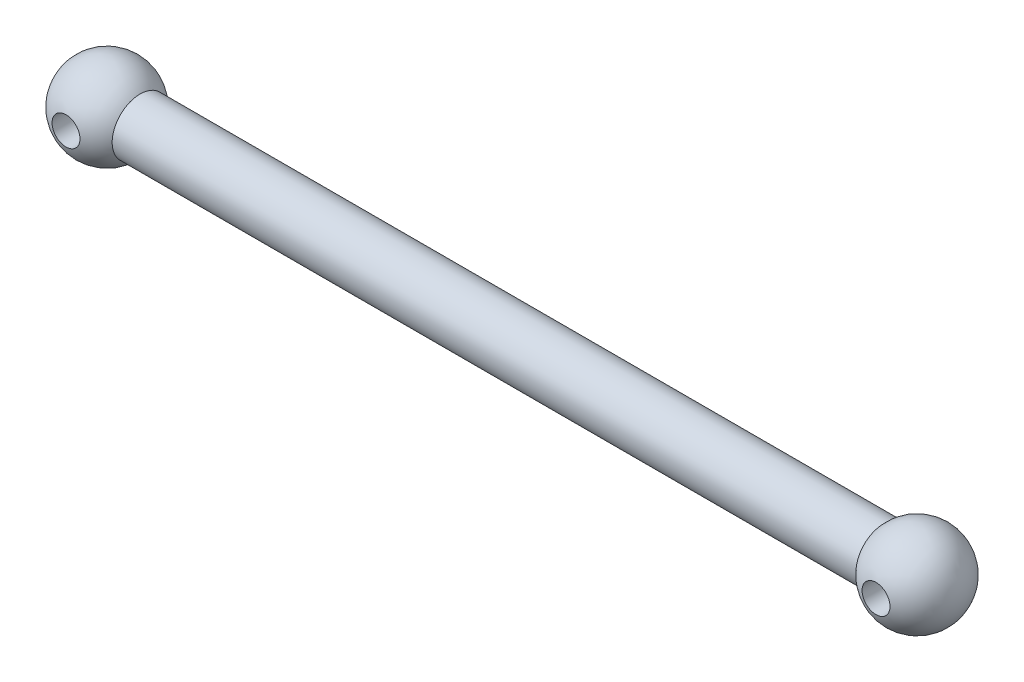
ISO-10303-21;
HEADER;
FILE_DESCRIPTION(('STEP AP214'),'2;1');
FILE_NAME('part.step','',(''),(''),'','','');
FILE_SCHEMA(('AUTOMOTIVE_DESIGN { 1 0 10303 214 1 1 1 1 }'));
ENDSEC;
DATA;
#1=APPLICATION_CONTEXT('core data for automotive mechanical design processes');
#2=APPLICATION_PROTOCOL_DEFINITION('international standard','automotive_design',2000,#1);
#3=PRODUCT_CONTEXT('',#1,'mechanical');
#4=PRODUCT('Part','Part','',(#3));
#5=PRODUCT_RELATED_PRODUCT_CATEGORY('part','',(#4));
#6=PRODUCT_DEFINITION_FORMATION('','',#4);
#7=PRODUCT_DEFINITION_CONTEXT('part definition',#1,'design');
#8=PRODUCT_DEFINITION('design','',#6,#7);
#9=PRODUCT_DEFINITION_SHAPE('','',#8);
#10=(LENGTH_UNIT() NAMED_UNIT(*) SI_UNIT(.MILLI.,.METRE.));
#11=(NAMED_UNIT(*) PLANE_ANGLE_UNIT() SI_UNIT($,.RADIAN.));
#12=(NAMED_UNIT(*) SI_UNIT($,.STERADIAN.) SOLID_ANGLE_UNIT());
#13=UNCERTAINTY_MEASURE_WITH_UNIT(LENGTH_MEASURE(1.E-05),#10,'distance_accuracy_value','');
#14=(GEOMETRIC_REPRESENTATION_CONTEXT(3) GLOBAL_UNCERTAINTY_ASSIGNED_CONTEXT((#13)) GLOBAL_UNIT_ASSIGNED_CONTEXT((#10,
#11,#12)) REPRESENTATION_CONTEXT('',''));
#15=CARTESIAN_POINT('',(0.,0.,0.));
#16=DIRECTION('',(0.,0.,1.));
#17=DIRECTION('',(1.,0.,0.));
#18=AXIS2_PLACEMENT_3D('',#15,#16,#17);
#19=CARTESIAN_POINT('',(-29.,0.,0.));
#20=DIRECTION('',(-1.,0.,0.));
#21=DIRECTION('',(0.,0.,-1.));
#22=AXIS2_PLACEMENT_3D('',#19,#20,#21);
#23=SPHERICAL_SURFACE('',#22,3.1);
#24=CARTESIAN_POINT('',(-29.,0.,2.93428015022424));
#25=DIRECTION('',(0.,0.,-1.));
#26=DIRECTION('',(-1.,0.,0.));
#27=AXIS2_PLACEMENT_3D('',#24,#25,#26);
#28=CIRCLE('',#27,0.999999999999998);
#29=CARTESIAN_POINT('',(-30.,0.,2.93428015022424));
#30=VERTEX_POINT('',#29);
#31=EDGE_CURVE('E46',#30,#30,#28,.F.);
#32=ORIENTED_EDGE('',*,*,#31,.F.);
#33=EDGE_LOOP('',(#32));
#34=FACE_BOUND('',#33,.T.);
#35=CARTESIAN_POINT('',(-29.,0.,-2.93428015022424));
#36=DIRECTION('',(0.,0.,1.));
#37=DIRECTION('',(1.,0.,0.));
#38=AXIS2_PLACEMENT_3D('',#35,#36,#37);
#39=CIRCLE('',#38,0.999999999999998);
#40=CARTESIAN_POINT('',(-28.,0.,-2.93428015022424));
#41=VERTEX_POINT('',#40);
#42=EDGE_CURVE('E66',#41,#41,#39,.F.);
#43=ORIENTED_EDGE('',*,*,#42,.F.);
#44=EDGE_LOOP('',(#43));
#45=FACE_BOUND('',#44,.T.);
#46=CARTESIAN_POINT('',(-26.6314561435346,0.,0.));
#47=DIRECTION('',(-1.,0.,0.));
#48=DIRECTION('',(0.,0.,1.));
#49=AXIS2_PLACEMENT_3D('',#46,#47,#48);
#50=CIRCLE('',#49,2.);
#51=CARTESIAN_POINT('',(-26.6314561435346,0.,2.));
#52=VERTEX_POINT('',#51);
#53=EDGE_CURVE('E10',#52,#52,#50,.T.);
#54=ORIENTED_EDGE('',*,*,#53,.T.);
#55=EDGE_LOOP('',(#54));
#56=FACE_BOUND('',#55,.T.);
#57=ADVANCED_FACE('F43',(#34,#45,#56),#23,.T.);
#58=CARTESIAN_POINT('',(-29.,0.,0.));
#59=DIRECTION('',(-1.,0.,0.));
#60=DIRECTION('',(0.,0.,1.));
#61=AXIS2_PLACEMENT_3D('',#58,#59,#60);
#62=CYLINDRICAL_SURFACE('',#61,2.);
#63=CARTESIAN_POINT('',(26.6314561435346,0.,0.));
#64=DIRECTION('',(-1.,0.,0.));
#65=DIRECTION('',(0.,0.,1.));
#66=AXIS2_PLACEMENT_3D('',#63,#64,#65);
#67=CIRCLE('',#66,2.);
#68=CARTESIAN_POINT('',(26.6314561435346,0.,1.99999999999999));
#69=VERTEX_POINT('',#68);
#70=EDGE_CURVE('E51',#69,#69,#67,.T.);
#71=ORIENTED_EDGE('',*,*,#70,.T.);
#72=EDGE_LOOP('',(#71));
#73=FACE_BOUND('',#72,.T.);
#74=ORIENTED_EDGE('',*,*,#53,.F.);
#75=EDGE_LOOP('',(#74));
#76=FACE_BOUND('',#75,.T.);
#77=ADVANCED_FACE('F79',(#73,#76),#62,.T.);
#78=CARTESIAN_POINT('',(29.,0.,0.));
#79=DIRECTION('',(-1.,0.,0.));
#80=DIRECTION('',(0.,0.,1.));
#81=AXIS2_PLACEMENT_3D('',#78,#79,#80);
#82=SPHERICAL_SURFACE('',#81,3.1);
#83=CARTESIAN_POINT('',(29.,0.,2.93428015022423));
#84=DIRECTION('',(0.,0.,-1.));
#85=DIRECTION('',(-1.,0.,0.));
#86=AXIS2_PLACEMENT_3D('',#83,#84,#85);
#87=CIRCLE('',#86,0.999999999999998);
#88=CARTESIAN_POINT('',(28.,0.,2.93428015022423));
#89=VERTEX_POINT('',#88);
#90=EDGE_CURVE('E63',#89,#89,#87,.F.);
#91=ORIENTED_EDGE('',*,*,#90,.F.);
#92=EDGE_LOOP('',(#91));
#93=FACE_BOUND('',#92,.T.);
#94=CARTESIAN_POINT('',(29.,0.,-2.93428015022425));
#95=DIRECTION('',(0.,0.,1.));
#96=DIRECTION('',(1.,0.,0.));
#97=AXIS2_PLACEMENT_3D('',#94,#95,#96);
#98=CIRCLE('',#97,0.999999999999998);
#99=CARTESIAN_POINT('',(30.,0.,-2.93428015022425));
#100=VERTEX_POINT('',#99);
#101=EDGE_CURVE('E59',#100,#100,#98,.F.);
#102=ORIENTED_EDGE('',*,*,#101,.F.);
#103=EDGE_LOOP('',(#102));
#104=FACE_BOUND('',#103,.T.);
#105=ORIENTED_EDGE('',*,*,#70,.F.);
#106=EDGE_LOOP('',(#105));
#107=FACE_BOUND('',#106,.T.);
#108=ADVANCED_FACE('F83',(#93,#104,#107),#82,.T.);
#109=CARTESIAN_POINT('',(29.,0.,-3.10000000000001));
#110=DIRECTION('',(0.,0.,1.));
#111=DIRECTION('',(1.,0.,0.));
#112=AXIS2_PLACEMENT_3D('',#109,#110,#111);
#113=CYLINDRICAL_SURFACE('',#112,0.999999999999998);
#114=ORIENTED_EDGE('',*,*,#90,.T.);
#115=EDGE_LOOP('',(#114));
#116=FACE_BOUND('',#115,.T.);
#117=ORIENTED_EDGE('',*,*,#101,.T.);
#118=EDGE_LOOP('',(#117));
#119=FACE_BOUND('',#118,.T.);
#120=ADVANCED_FACE('F88',(#116,#119),#113,.F.);
#121=CARTESIAN_POINT('',(-29.,0.,-3.10000000000001));
#122=DIRECTION('',(0.,0.,1.));
#123=DIRECTION('',(1.,0.,0.));
#124=AXIS2_PLACEMENT_3D('',#121,#122,#123);
#125=CYLINDRICAL_SURFACE('',#124,0.999999999999998);
#126=ORIENTED_EDGE('',*,*,#31,.T.);
#127=EDGE_LOOP('',(#126));
#128=FACE_BOUND('',#127,.T.);
#129=ORIENTED_EDGE('',*,*,#42,.T.);
#130=EDGE_LOOP('',(#129));
#131=FACE_BOUND('',#130,.T.);
#132=ADVANCED_FACE('F75',(#128,#131),#125,.F.);
#133=CLOSED_SHELL('',(#57,#77,#108,#120,#132));
#134=MANIFOLD_SOLID_BREP('B2',#133);
#135=ADVANCED_BREP_SHAPE_REPRESENTATION('',(#18,#134),#14);
#136=SHAPE_DEFINITION_REPRESENTATION(#9,#135);
ENDSEC;
END-ISO-10303-21;
